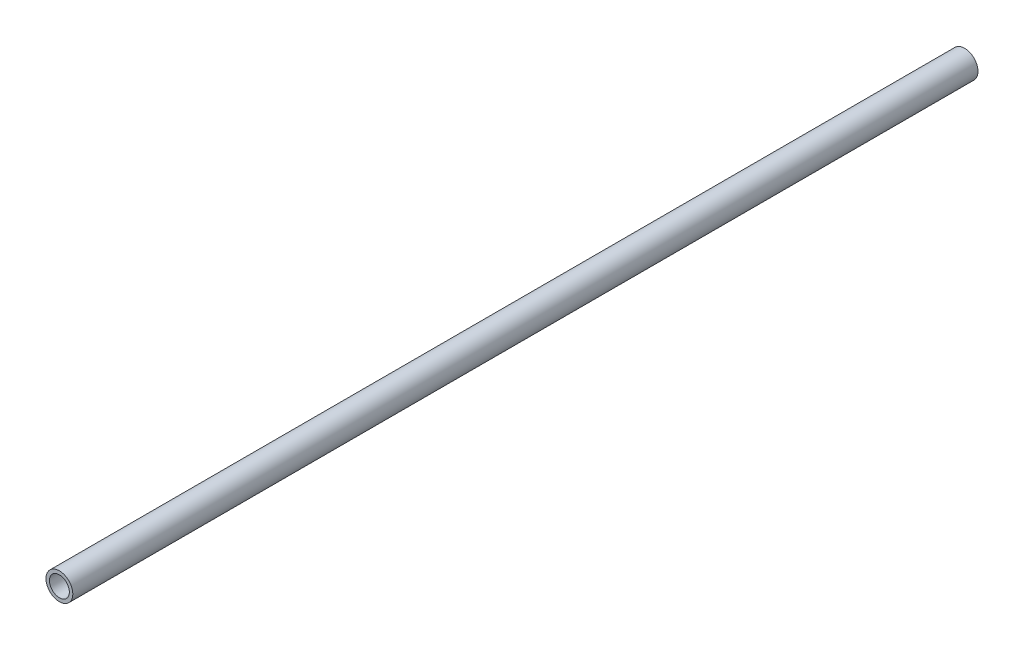
ISO-10303-21;
HEADER;
FILE_DESCRIPTION(('STEP AP214'),'2;1');
FILE_NAME('part.step','',(''),(''),'','','');
FILE_SCHEMA(('AUTOMOTIVE_DESIGN { 1 0 10303 214 1 1 1 1 }'));
ENDSEC;
DATA;
#1=APPLICATION_CONTEXT('core data for automotive mechanical design processes');
#2=APPLICATION_PROTOCOL_DEFINITION('international standard','automotive_design',2000,#1);
#3=PRODUCT_CONTEXT('',#1,'mechanical');
#4=PRODUCT('Part','Part','',(#3));
#5=PRODUCT_RELATED_PRODUCT_CATEGORY('part','',(#4));
#6=PRODUCT_DEFINITION_FORMATION('','',#4);
#7=PRODUCT_DEFINITION_CONTEXT('part definition',#1,'design');
#8=PRODUCT_DEFINITION('design','',#6,#7);
#9=PRODUCT_DEFINITION_SHAPE('','',#8);
#10=(LENGTH_UNIT() NAMED_UNIT(*) SI_UNIT(.MILLI.,.METRE.));
#11=(NAMED_UNIT(*) PLANE_ANGLE_UNIT() SI_UNIT($,.RADIAN.));
#12=(NAMED_UNIT(*) SI_UNIT($,.STERADIAN.) SOLID_ANGLE_UNIT());
#13=UNCERTAINTY_MEASURE_WITH_UNIT(LENGTH_MEASURE(1.E-05),#10,'distance_accuracy_value','');
#14=(GEOMETRIC_REPRESENTATION_CONTEXT(3) GLOBAL_UNCERTAINTY_ASSIGNED_CONTEXT((#13)) GLOBAL_UNIT_ASSIGNED_CONTEXT((#10,
#11,#12)) REPRESENTATION_CONTEXT('',''));
#15=CARTESIAN_POINT('',(0.,0.,0.));
#16=DIRECTION('',(0.,0.,1.));
#17=DIRECTION('',(1.,0.,0.));
#18=AXIS2_PLACEMENT_3D('',#15,#16,#17);
#19=CARTESIAN_POINT('',(0.,0.,360.));
#20=DIRECTION('',(0.,0.,1.));
#21=DIRECTION('',(1.,0.,0.));
#22=AXIS2_PLACEMENT_3D('',#19,#20,#21);
#23=PLANE('',#22);
#24=CARTESIAN_POINT('',(0.,0.,360.));
#25=DIRECTION('',(0.,0.,1.));
#26=DIRECTION('',(1.,0.,0.));
#27=AXIS2_PLACEMENT_3D('',#24,#25,#26);
#28=CIRCLE('',#27,10.668);
#29=CARTESIAN_POINT('',(10.668,0.,360.));
#30=VERTEX_POINT('',#29);
#31=EDGE_CURVE('E11',#30,#30,#28,.T.);
#32=ORIENTED_EDGE('',*,*,#31,.T.);
#33=EDGE_LOOP('',(#32));
#34=FACE_BOUND('',#33,.T.);
#35=CARTESIAN_POINT('',(0.,0.,360.));
#36=DIRECTION('',(0.,0.,1.));
#37=DIRECTION('',(1.,0.,0.));
#38=AXIS2_PLACEMENT_3D('',#35,#36,#37);
#39=CIRCLE('',#38,7.8994);
#40=CARTESIAN_POINT('',(7.8994,0.,360.));
#41=VERTEX_POINT('',#40);
#42=EDGE_CURVE('E50',#41,#41,#39,.T.);
#43=ORIENTED_EDGE('',*,*,#42,.F.);
#44=EDGE_LOOP('',(#43));
#45=FACE_BOUND('',#44,.T.);
#46=ADVANCED_FACE('F39',(#34,#45),#23,.T.);
#47=CARTESIAN_POINT('',(0.,0.,-360.));
#48=DIRECTION('',(0.,0.,1.));
#49=DIRECTION('',(1.,0.,0.));
#50=AXIS2_PLACEMENT_3D('',#47,#48,#49);
#51=PLANE('',#50);
#52=CARTESIAN_POINT('',(0.,0.,-360.));
#53=DIRECTION('',(0.,0.,1.));
#54=DIRECTION('',(1.,0.,0.));
#55=AXIS2_PLACEMENT_3D('',#52,#53,#54);
#56=CIRCLE('',#55,10.668);
#57=CARTESIAN_POINT('',(10.668,0.,-360.));
#58=VERTEX_POINT('',#57);
#59=EDGE_CURVE('E43',#58,#58,#56,.T.);
#60=ORIENTED_EDGE('',*,*,#59,.F.);
#61=EDGE_LOOP('',(#60));
#62=FACE_BOUND('',#61,.T.);
#63=CARTESIAN_POINT('',(0.,0.,-360.));
#64=DIRECTION('',(0.,0.,1.));
#65=DIRECTION('',(1.,0.,0.));
#66=AXIS2_PLACEMENT_3D('',#63,#64,#65);
#67=CIRCLE('',#66,7.8994);
#68=CARTESIAN_POINT('',(7.8994,0.,-360.));
#69=VERTEX_POINT('',#68);
#70=EDGE_CURVE('E52',#69,#69,#67,.T.);
#71=ORIENTED_EDGE('',*,*,#70,.T.);
#72=EDGE_LOOP('',(#71));
#73=FACE_BOUND('',#72,.T.);
#74=ADVANCED_FACE('F62',(#62,#73),#51,.F.);
#75=CARTESIAN_POINT('',(0.,0.,360.));
#76=DIRECTION('',(0.,0.,-1.));
#77=DIRECTION('',(-1.,0.,0.));
#78=AXIS2_PLACEMENT_3D('',#75,#76,#77);
#79=CYLINDRICAL_SURFACE('',#78,10.668);
#80=ORIENTED_EDGE('',*,*,#31,.F.);
#81=EDGE_LOOP('',(#80));
#82=FACE_BOUND('',#81,.T.);
#83=ORIENTED_EDGE('',*,*,#59,.T.);
#84=EDGE_LOOP('',(#83));
#85=FACE_BOUND('',#84,.T.);
#86=ADVANCED_FACE('F41',(#82,#85),#79,.T.);
#87=CARTESIAN_POINT('',(0.,0.,360.));
#88=DIRECTION('',(0.,0.,-1.));
#89=DIRECTION('',(-1.,0.,0.));
#90=AXIS2_PLACEMENT_3D('',#87,#88,#89);
#91=CYLINDRICAL_SURFACE('',#90,7.8994);
#92=ORIENTED_EDGE('',*,*,#42,.T.);
#93=EDGE_LOOP('',(#92));
#94=FACE_BOUND('',#93,.T.);
#95=ORIENTED_EDGE('',*,*,#70,.F.);
#96=EDGE_LOOP('',(#95));
#97=FACE_BOUND('',#96,.T.);
#98=ADVANCED_FACE('F58',(#94,#97),#91,.F.);
#99=CLOSED_SHELL('',(#46,#74,#86,#98));
#100=MANIFOLD_SOLID_BREP('B2',#99);
#101=ADVANCED_BREP_SHAPE_REPRESENTATION('',(#18,#100),#14);
#102=SHAPE_DEFINITION_REPRESENTATION(#9,#101);
ENDSEC;
END-ISO-10303-21;
